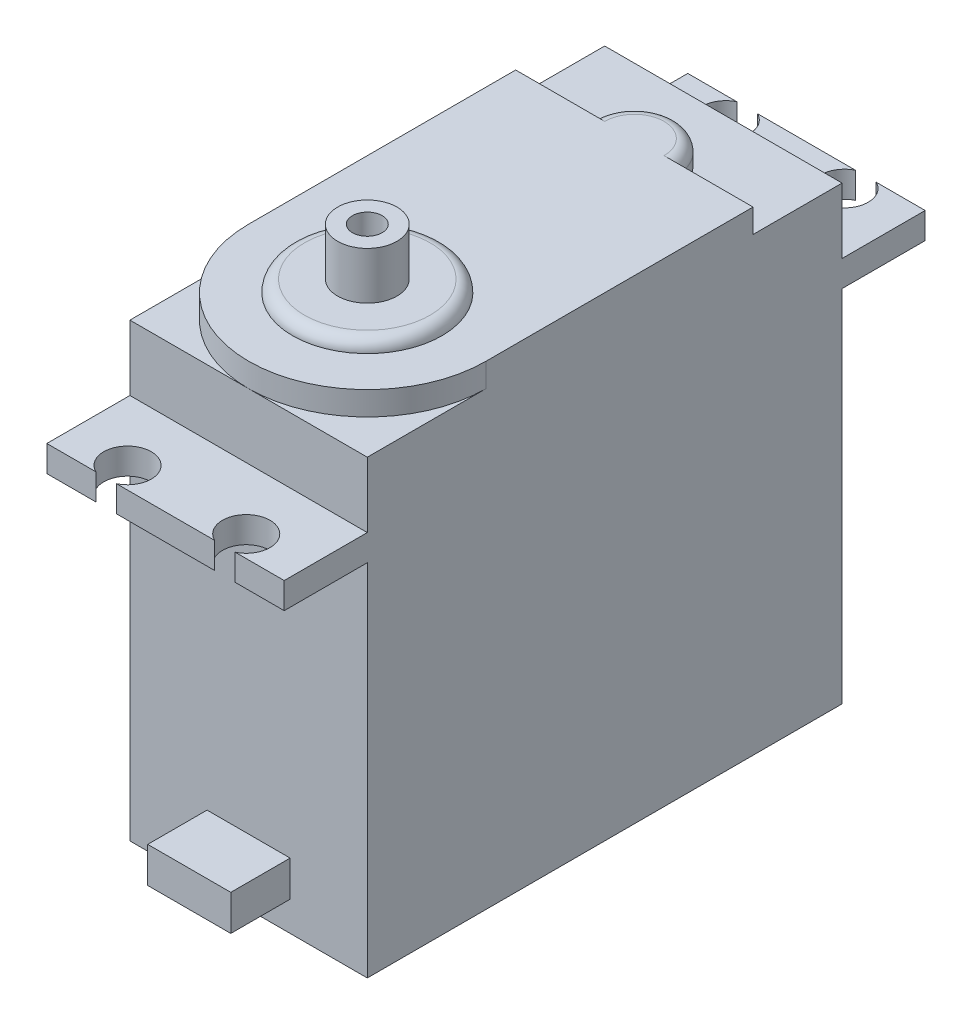
ISO-10303-21;
HEADER;
FILE_DESCRIPTION(('STEP AP214'),'2;1');
FILE_NAME('part.step','',(''),(''),'','','');
FILE_SCHEMA(('AUTOMOTIVE_DESIGN { 1 0 10303 214 1 1 1 1 }'));
ENDSEC;
DATA;
#1=APPLICATION_CONTEXT('core data for automotive mechanical design processes');
#2=APPLICATION_PROTOCOL_DEFINITION('international standard','automotive_design',2000,#1);
#3=PRODUCT_CONTEXT('',#1,'mechanical');
#4=PRODUCT('Part','Part','',(#3));
#5=PRODUCT_RELATED_PRODUCT_CATEGORY('part','',(#4));
#6=PRODUCT_DEFINITION_FORMATION('','',#4);
#7=PRODUCT_DEFINITION_CONTEXT('part definition',#1,'design');
#8=PRODUCT_DEFINITION('design','',#6,#7);
#9=PRODUCT_DEFINITION_SHAPE('','',#8);
#10=(LENGTH_UNIT() NAMED_UNIT(*) SI_UNIT(.MILLI.,.METRE.));
#11=(NAMED_UNIT(*) PLANE_ANGLE_UNIT() SI_UNIT($,.RADIAN.));
#12=(NAMED_UNIT(*) SI_UNIT($,.STERADIAN.) SOLID_ANGLE_UNIT());
#13=UNCERTAINTY_MEASURE_WITH_UNIT(LENGTH_MEASURE(1.E-05),#10,'distance_accuracy_value','');
#14=(GEOMETRIC_REPRESENTATION_CONTEXT(3) GLOBAL_UNCERTAINTY_ASSIGNED_CONTEXT((#13)) GLOBAL_UNIT_ASSIGNED_CONTEXT((#10,
#11,#12)) REPRESENTATION_CONTEXT('',''));
#15=CARTESIAN_POINT('',(0.,0.,0.));
#16=DIRECTION('',(0.,0.,1.));
#17=DIRECTION('',(1.,0.,0.));
#18=AXIS2_PLACEMENT_3D('',#15,#16,#17);
#19=CARTESIAN_POINT('',(0.,38.,0.));
#20=DIRECTION('',(0.,-1.,0.));
#21=DIRECTION('',(0.,0.,-1.));
#22=AXIS2_PLACEMENT_3D('',#19,#20,#21);
#23=PLANE('',#22);
#24=DIRECTION('',(-1.,0.,0.));
#25=VECTOR('',#24,1.);
#26=CARTESIAN_POINT('',(20.,38.,-32.5));
#27=LINE('',#26,#25);
#28=CARTESIAN_POINT('',(20.,38.,-32.5));
#29=VERTEX_POINT('',#28);
#30=CARTESIAN_POINT('',(13.5,38.,-32.5));
#31=VERTEX_POINT('',#30);
#32=EDGE_CURVE('E455',#29,#31,#27,.T.);
#33=ORIENTED_EDGE('',*,*,#32,.F.);
#34=DIRECTION('',(0.,0.,-1.));
#35=VECTOR('',#34,1.);
#36=CARTESIAN_POINT('',(20.,38.,0.));
#37=LINE('',#36,#35);
#38=CARTESIAN_POINT('',(20.,38.,-40.));
#39=VERTEX_POINT('',#38);
#40=EDGE_CURVE('E275',#29,#39,#37,.T.);
#41=ORIENTED_EDGE('',*,*,#40,.T.);
#42=DIRECTION('',(-1.,0.,0.));
#43=VECTOR('',#42,1.);
#44=CARTESIAN_POINT('',(0.,38.,-40.));
#45=LINE('',#44,#43);
#46=CARTESIAN_POINT('',(0.,38.,-40.));
#47=VERTEX_POINT('',#46);
#48=EDGE_CURVE('E404',#39,#47,#45,.T.);
#49=ORIENTED_EDGE('',*,*,#48,.T.);
#50=DIRECTION('',(0.,0.,1.));
#51=VECTOR('',#50,1.);
#52=CARTESIAN_POINT('',(0.,38.,0.));
#53=LINE('',#52,#51);
#54=CARTESIAN_POINT('',(0.,38.,-32.5));
#55=VERTEX_POINT('',#54);
#56=EDGE_CURVE('E395',#47,#55,#53,.T.);
#57=ORIENTED_EDGE('',*,*,#56,.T.);
#58=DIRECTION('',(-1.,0.,0.));
#59=VECTOR('',#58,1.);
#60=CARTESIAN_POINT('',(6.5,38.,-32.5));
#61=LINE('',#60,#59);
#62=CARTESIAN_POINT('',(6.5,38.,-32.5));
#63=VERTEX_POINT('',#62);
#64=EDGE_CURVE('E507',#63,#55,#61,.T.);
#65=ORIENTED_EDGE('',*,*,#64,.F.);
#66=CARTESIAN_POINT('',(10.,38.,-32.5));
#67=DIRECTION('',(0.,1.,0.));
#68=DIRECTION('',(0.,0.,1.));
#69=AXIS2_PLACEMENT_3D('',#66,#67,#68);
#70=CIRCLE('',#69,3.5);
#71=EDGE_CURVE('E531',#31,#63,#70,.T.);
#72=ORIENTED_EDGE('',*,*,#71,.F.);
#73=EDGE_LOOP('',(#33,#41,#49,#57,#65,#72));
#74=FACE_BOUND('',#73,.T.);
#75=ADVANCED_FACE('F45',(#74),#23,.F.);
#76=CARTESIAN_POINT('',(10.,38.,-10.));
#77=DIRECTION('',(0.,1.,0.));
#78=DIRECTION('',(0.,0.,1.));
#79=AXIS2_PLACEMENT_3D('',#76,#77,#78);
#80=CIRCLE('',#79,10.);
#81=CARTESIAN_POINT('',(0.,38.,-10.));
#82=VERTEX_POINT('',#81);
#83=CARTESIAN_POINT('',(10.,38.,0.));
#84=VERTEX_POINT('',#83);
#85=EDGE_CURVE('E269',#82,#84,#80,.T.);
#86=ORIENTED_EDGE('',*,*,#85,.F.);
#87=CARTESIAN_POINT('',(0.,38.,0.));
#88=VERTEX_POINT('',#87);
#89=EDGE_CURVE('E398',#82,#88,#53,.T.);
#90=ORIENTED_EDGE('',*,*,#89,.T.);
#91=DIRECTION('',(1.,0.,0.));
#92=VECTOR('',#91,1.);
#93=CARTESIAN_POINT('',(0.,38.,0.));
#94=LINE('',#93,#92);
#95=EDGE_CURVE('E399',#88,#84,#94,.T.);
#96=ORIENTED_EDGE('',*,*,#95,.T.);
#97=EDGE_LOOP('',(#86,#90,#96));
#98=FACE_BOUND('',#97,.T.);
#99=ADVANCED_FACE('F476',(#98),#23,.F.);
#100=CARTESIAN_POINT('',(0.,0.,-47.));
#101=DIRECTION('',(0.,0.,1.));
#102=DIRECTION('',(1.,0.,0.));
#103=AXIS2_PLACEMENT_3D('',#100,#101,#102);
#104=PLANE('',#103);
#105=DIRECTION('',(1.,0.,0.));
#106=VECTOR('',#105,1.);
#107=CARTESIAN_POINT('',(0.,30.3,-47.));
#108=LINE('',#107,#106);
#109=CARTESIAN_POINT('',(5.87177978870814,30.3,-47.));
#110=VERTEX_POINT('',#109);
#111=CARTESIAN_POINT('',(14.1282202112918,30.3,-47.));
#112=VERTEX_POINT('',#111);
#113=EDGE_CURVE('E330',#110,#112,#108,.T.);
#114=ORIENTED_EDGE('',*,*,#113,.F.);
#115=DIRECTION('',(0.,1.,0.));
#116=VECTOR('',#115,1.);
#117=CARTESIAN_POINT('',(5.87177978870814,25.5,-47.));
#118=LINE('',#117,#116);
#119=CARTESIAN_POINT('',(5.87177978870814,32.5,-47.));
#120=VERTEX_POINT('',#119);
#121=EDGE_CURVE('E303',#110,#120,#118,.T.);
#122=ORIENTED_EDGE('',*,*,#121,.T.);
#123=DIRECTION('',(-1.,0.,0.));
#124=VECTOR('',#123,1.);
#125=CARTESIAN_POINT('',(0.,32.5,-47.));
#126=LINE('',#125,#124);
#127=CARTESIAN_POINT('',(14.1282202112918,32.5,-47.));
#128=VERTEX_POINT('',#127);
#129=EDGE_CURVE('E338',#128,#120,#126,.T.);
#130=ORIENTED_EDGE('',*,*,#129,.F.);
#131=DIRECTION('',(0.,1.,0.));
#132=VECTOR('',#131,1.);
#133=CARTESIAN_POINT('',(14.1282202112918,25.5,-47.));
#134=LINE('',#133,#132);
#135=EDGE_CURVE('E292',#128,#112,#134,.F.);
#136=ORIENTED_EDGE('',*,*,#135,.T.);
#137=EDGE_LOOP('',(#114,#122,#130,#136));
#138=FACE_BOUND('',#137,.T.);
#139=ADVANCED_FACE('F483',(#138),#104,.F.);
#140=CARTESIAN_POINT('',(15.8717797887081,30.3,-47.));
#141=VERTEX_POINT('',#140);
#142=CARTESIAN_POINT('',(20.,30.3,-47.));
#143=VERTEX_POINT('',#142);
#144=EDGE_CURVE('E325',#141,#143,#108,.T.);
#145=ORIENTED_EDGE('',*,*,#144,.F.);
#146=DIRECTION('',(0.,1.,0.));
#147=VECTOR('',#146,1.);
#148=CARTESIAN_POINT('',(15.8717797887081,25.5,-47.));
#149=LINE('',#148,#147);
#150=CARTESIAN_POINT('',(15.8717797887081,32.5,-47.));
#151=VERTEX_POINT('',#150);
#152=EDGE_CURVE('E295',#141,#151,#149,.T.);
#153=ORIENTED_EDGE('',*,*,#152,.T.);
#154=CARTESIAN_POINT('',(20.,32.5,-47.));
#155=VERTEX_POINT('',#154);
#156=EDGE_CURVE('E334',#155,#151,#126,.T.);
#157=ORIENTED_EDGE('',*,*,#156,.F.);
#158=DIRECTION('',(0.,1.,0.));
#159=VECTOR('',#158,1.);
#160=CARTESIAN_POINT('',(20.,32.5,-47.));
#161=LINE('',#160,#159);
#162=EDGE_CURVE('E329',#143,#155,#161,.T.);
#163=ORIENTED_EDGE('',*,*,#162,.F.);
#164=EDGE_LOOP('',(#145,#153,#157,#163));
#165=FACE_BOUND('',#164,.T.);
#166=ADVANCED_FACE('F620',(#165),#104,.F.);
#167=CARTESIAN_POINT('',(0.,0.,7.));
#168=DIRECTION('',(0.,0.,1.));
#169=DIRECTION('',(1.,0.,0.));
#170=AXIS2_PLACEMENT_3D('',#167,#168,#169);
#171=PLANE('',#170);
#172=DIRECTION('',(0.,1.,0.));
#173=VECTOR('',#172,1.);
#174=CARTESIAN_POINT('',(15.8717797887082,25.5,7.));
#175=LINE('',#174,#173);
#176=CARTESIAN_POINT('',(15.8717797887082,30.3,7.));
#177=VERTEX_POINT('',#176);
#178=CARTESIAN_POINT('',(15.8717797887082,32.5,7.));
#179=VERTEX_POINT('',#178);
#180=EDGE_CURVE('E445',#177,#179,#175,.T.);
#181=ORIENTED_EDGE('',*,*,#180,.F.);
#182=DIRECTION('',(1.,0.,0.));
#183=VECTOR('',#182,1.);
#184=CARTESIAN_POINT('',(0.,30.3,7.));
#185=LINE('',#184,#183);
#186=CARTESIAN_POINT('',(20.,30.3,7.));
#187=VERTEX_POINT('',#186);
#188=EDGE_CURVE('E309',#177,#187,#185,.T.);
#189=ORIENTED_EDGE('',*,*,#188,.T.);
#190=DIRECTION('',(0.,1.,0.));
#191=VECTOR('',#190,1.);
#192=CARTESIAN_POINT('',(20.,32.5,7.));
#193=LINE('',#192,#191);
#194=CARTESIAN_POINT('',(20.,32.5,7.));
#195=VERTEX_POINT('',#194);
#196=EDGE_CURVE('E313',#187,#195,#193,.T.);
#197=ORIENTED_EDGE('',*,*,#196,.T.);
#198=DIRECTION('',(-1.,0.,0.));
#199=VECTOR('',#198,1.);
#200=CARTESIAN_POINT('',(0.,32.5,7.));
#201=LINE('',#200,#199);
#202=EDGE_CURVE('E318',#195,#179,#201,.T.);
#203=ORIENTED_EDGE('',*,*,#202,.T.);
#204=EDGE_LOOP('',(#181,#189,#197,#203));
#205=FACE_BOUND('',#204,.T.);
#206=ADVANCED_FACE('F613',(#205),#171,.T.);
#207=DIRECTION('',(0.,1.,0.));
#208=VECTOR('',#207,1.);
#209=CARTESIAN_POINT('',(14.1282202112919,25.5,7.));
#210=LINE('',#209,#208);
#211=CARTESIAN_POINT('',(14.1282202112919,32.5,7.));
#212=VERTEX_POINT('',#211);
#213=CARTESIAN_POINT('',(14.1282202112919,30.3,7.));
#214=VERTEX_POINT('',#213);
#215=EDGE_CURVE('E443',#212,#214,#210,.F.);
#216=ORIENTED_EDGE('',*,*,#215,.F.);
#217=CARTESIAN_POINT('',(5.87177978870814,32.5,7.));
#218=VERTEX_POINT('',#217);
#219=EDGE_CURVE('E322',#212,#218,#201,.T.);
#220=ORIENTED_EDGE('',*,*,#219,.T.);
#221=DIRECTION('',(0.,1.,0.));
#222=VECTOR('',#221,1.);
#223=CARTESIAN_POINT('',(5.87177978870814,25.5,7.));
#224=LINE('',#223,#222);
#225=CARTESIAN_POINT('',(5.87177978870814,30.3,7.));
#226=VERTEX_POINT('',#225);
#227=EDGE_CURVE('E441',#226,#218,#224,.T.);
#228=ORIENTED_EDGE('',*,*,#227,.F.);
#229=EDGE_CURVE('E314',#226,#214,#185,.T.);
#230=ORIENTED_EDGE('',*,*,#229,.T.);
#231=EDGE_LOOP('',(#216,#220,#228,#230));
#232=FACE_BOUND('',#231,.T.);
#233=ADVANCED_FACE('F609',(#232),#171,.T.);
#234=CARTESIAN_POINT('',(0.,38.,0.));
#235=DIRECTION('',(0.,0.,-1.));
#236=DIRECTION('',(-1.,0.,0.));
#237=AXIS2_PLACEMENT_3D('',#234,#235,#236);
#238=PLANE('',#237);
#239=DIRECTION('',(0.,-1.,0.));
#240=VECTOR('',#239,1.);
#241=CARTESIAN_POINT('',(0.,38.,0.));
#242=LINE('',#241,#240);
#243=CARTESIAN_POINT('',(0.,32.5,0.));
#244=VERTEX_POINT('',#243);
#245=EDGE_CURVE('E430',#88,#244,#242,.T.);
#246=ORIENTED_EDGE('',*,*,#245,.T.);
#247=DIRECTION('',(1.,0.,0.));
#248=VECTOR('',#247,1.);
#249=CARTESIAN_POINT('',(0.,32.5,0.));
#250=LINE('',#249,#248);
#251=CARTESIAN_POINT('',(20.,32.5,0.));
#252=VERTEX_POINT('',#251);
#253=EDGE_CURVE('E355',#244,#252,#250,.T.);
#254=ORIENTED_EDGE('',*,*,#253,.T.);
#255=DIRECTION('',(0.,-1.,0.));
#256=VECTOR('',#255,1.);
#257=CARTESIAN_POINT('',(20.,38.,0.));
#258=LINE('',#257,#256);
#259=CARTESIAN_POINT('',(20.,38.,0.));
#260=VERTEX_POINT('',#259);
#261=EDGE_CURVE('E426',#260,#252,#258,.T.);
#262=ORIENTED_EDGE('',*,*,#261,.F.);
#263=EDGE_CURVE('E397',#84,#260,#94,.T.);
#264=ORIENTED_EDGE('',*,*,#263,.F.);
#265=ORIENTED_EDGE('',*,*,#95,.F.);
#266=EDGE_LOOP('',(#246,#254,#262,#264,#265));
#267=FACE_BOUND('',#266,.T.);
#268=ADVANCED_FACE('F511',(#267),#238,.F.);
#269=CARTESIAN_POINT('',(0.,38.,-40.));
#270=DIRECTION('',(0.,0.,1.));
#271=DIRECTION('',(1.,0.,0.));
#272=AXIS2_PLACEMENT_3D('',#269,#270,#271);
#273=PLANE('',#272);
#274=DIRECTION('',(0.,-1.,0.));
#275=VECTOR('',#274,1.);
#276=CARTESIAN_POINT('',(20.,38.,-40.));
#277=LINE('',#276,#275);
#278=CARTESIAN_POINT('',(20.,32.5,-40.));
#279=VERTEX_POINT('',#278);
#280=EDGE_CURVE('E422',#39,#279,#277,.T.);
#281=ORIENTED_EDGE('',*,*,#280,.T.);
#282=DIRECTION('',(-1.,0.,0.));
#283=VECTOR('',#282,1.);
#284=CARTESIAN_POINT('',(0.,32.5,-40.));
#285=LINE('',#284,#283);
#286=CARTESIAN_POINT('',(0.,32.5,-40.));
#287=VERTEX_POINT('',#286);
#288=EDGE_CURVE('E436',#279,#287,#285,.T.);
#289=ORIENTED_EDGE('',*,*,#288,.T.);
#290=DIRECTION('',(0.,-1.,0.));
#291=VECTOR('',#290,1.);
#292=CARTESIAN_POINT('',(0.,38.,-40.));
#293=LINE('',#292,#291);
#294=EDGE_CURVE('E418',#47,#287,#293,.T.);
#295=ORIENTED_EDGE('',*,*,#294,.F.);
#296=ORIENTED_EDGE('',*,*,#48,.F.);
#297=EDGE_LOOP('',(#281,#289,#295,#296));
#298=FACE_BOUND('',#297,.T.);
#299=ADVANCED_FACE('F499',(#298),#273,.F.);
#300=CARTESIAN_POINT('',(20.,30.3,0.));
#301=VERTEX_POINT('',#300);
#302=CARTESIAN_POINT('',(20.,0.,0.));
#303=VERTEX_POINT('',#302);
#304=EDGE_CURVE('E425',#301,#303,#258,.T.);
#305=ORIENTED_EDGE('',*,*,#304,.F.);
#306=DIRECTION('',(-1.,0.,0.));
#307=VECTOR('',#306,1.);
#308=CARTESIAN_POINT('',(0.,30.3,0.));
#309=LINE('',#308,#307);
#310=CARTESIAN_POINT('',(0.,30.3,0.));
#311=VERTEX_POINT('',#310);
#312=EDGE_CURVE('E341',#301,#311,#309,.T.);
#313=ORIENTED_EDGE('',*,*,#312,.T.);
#314=CARTESIAN_POINT('',(0.,0.,0.));
#315=VERTEX_POINT('',#314);
#316=EDGE_CURVE('E429',#311,#315,#242,.T.);
#317=ORIENTED_EDGE('',*,*,#316,.T.);
#318=DIRECTION('',(1.,0.,0.));
#319=VECTOR('',#318,1.);
#320=CARTESIAN_POINT('',(0.,0.,0.));
#321=LINE('',#320,#319);
#322=EDGE_CURVE('E409',#315,#303,#321,.T.);
#323=ORIENTED_EDGE('',*,*,#322,.T.);
#324=EDGE_LOOP('',(#305,#313,#317,#323));
#325=FACE_BOUND('',#324,.T.);
#326=DIRECTION('',(0.,-1.,0.));
#327=VECTOR('',#326,1.);
#328=CARTESIAN_POINT('',(6.5,2.5,0.));
#329=LINE('',#328,#327);
#330=CARTESIAN_POINT('',(6.5,5.5,0.));
#331=VERTEX_POINT('',#330);
#332=CARTESIAN_POINT('',(6.5,2.5,0.));
#333=VERTEX_POINT('',#332);
#334=EDGE_CURVE('E361',#331,#333,#329,.T.);
#335=ORIENTED_EDGE('',*,*,#334,.F.);
#336=DIRECTION('',(-1.,0.,0.));
#337=VECTOR('',#336,1.);
#338=CARTESIAN_POINT('',(6.5,5.5,0.));
#339=LINE('',#338,#337);
#340=CARTESIAN_POINT('',(13.5,5.5,0.));
#341=VERTEX_POINT('',#340);
#342=EDGE_CURVE('E366',#341,#331,#339,.T.);
#343=ORIENTED_EDGE('',*,*,#342,.F.);
#344=DIRECTION('',(0.,1.,0.));
#345=VECTOR('',#344,1.);
#346=CARTESIAN_POINT('',(13.5,2.5,0.));
#347=LINE('',#346,#345);
#348=CARTESIAN_POINT('',(13.5,2.5,0.));
#349=VERTEX_POINT('',#348);
#350=EDGE_CURVE('E378',#349,#341,#347,.T.);
#351=ORIENTED_EDGE('',*,*,#350,.F.);
#352=DIRECTION('',(1.,0.,0.));
#353=VECTOR('',#352,1.);
#354=CARTESIAN_POINT('',(6.5,2.5,0.));
#355=LINE('',#354,#353);
#356=EDGE_CURVE('E375',#333,#349,#355,.T.);
#357=ORIENTED_EDGE('',*,*,#356,.F.);
#358=EDGE_LOOP('',(#335,#343,#351,#357));
#359=FACE_BOUND('',#358,.T.);
#360=ADVANCED_FACE('F590',(#325,#359),#238,.F.);
#361=CARTESIAN_POINT('',(0.,38.,0.));
#362=DIRECTION('',(1.,0.,0.));
#363=DIRECTION('',(0.,0.,-1.));
#364=AXIS2_PLACEMENT_3D('',#361,#362,#363);
#365=PLANE('',#364);
#366=ORIENTED_EDGE('',*,*,#316,.F.);
#367=DIRECTION('',(0.,0.,1.));
#368=VECTOR('',#367,1.);
#369=CARTESIAN_POINT('',(0.,30.3,-47.));
#370=LINE('',#369,#368);
#371=CARTESIAN_POINT('',(0.,30.3,7.));
#372=VERTEX_POINT('',#371);
#373=EDGE_CURVE('E337',#311,#372,#370,.T.);
#374=ORIENTED_EDGE('',*,*,#373,.T.);
#375=DIRECTION('',(0.,-1.,0.));
#376=VECTOR('',#375,1.);
#377=CARTESIAN_POINT('',(0.,32.5,7.));
#378=LINE('',#377,#376);
#379=CARTESIAN_POINT('',(0.,32.5,7.));
#380=VERTEX_POINT('',#379);
#381=EDGE_CURVE('E306',#380,#372,#378,.T.);
#382=ORIENTED_EDGE('',*,*,#381,.F.);
#383=DIRECTION('',(0.,0.,1.));
#384=VECTOR('',#383,1.);
#385=CARTESIAN_POINT('',(0.,32.5,-47.));
#386=LINE('',#385,#384);
#387=EDGE_CURVE('E342',#244,#380,#386,.T.);
#388=ORIENTED_EDGE('',*,*,#387,.F.);
#389=ORIENTED_EDGE('',*,*,#245,.F.);
#390=ORIENTED_EDGE('',*,*,#89,.F.);
#391=DIRECTION('',(0.,-1.,0.));
#392=VECTOR('',#391,1.);
#393=CARTESIAN_POINT('',(0.,40.,-10.));
#394=LINE('',#393,#392);
#395=CARTESIAN_POINT('',(0.,40.,-10.));
#396=VERTEX_POINT('',#395);
#397=EDGE_CURVE('E517',#396,#82,#394,.T.);
#398=ORIENTED_EDGE('',*,*,#397,.F.);
#399=DIRECTION('',(0.,0.,1.));
#400=VECTOR('',#399,1.);
#401=CARTESIAN_POINT('',(0.,40.,-32.5));
#402=LINE('',#401,#400);
#403=CARTESIAN_POINT('',(0.,40.,-32.5));
#404=VERTEX_POINT('',#403);
#405=EDGE_CURVE('E537',#404,#396,#402,.T.);
#406=ORIENTED_EDGE('',*,*,#405,.F.);
#407=DIRECTION('',(0.,-1.,0.));
#408=VECTOR('',#407,1.);
#409=CARTESIAN_POINT('',(0.,40.,-32.5));
#410=LINE('',#409,#408);
#411=EDGE_CURVE('E524',#404,#55,#410,.T.);
#412=ORIENTED_EDGE('',*,*,#411,.T.);
#413=ORIENTED_EDGE('',*,*,#56,.F.);
#414=ORIENTED_EDGE('',*,*,#294,.T.);
#415=CARTESIAN_POINT('',(0.,32.5,-47.));
#416=VERTEX_POINT('',#415);
#417=EDGE_CURVE('E339',#416,#287,#386,.T.);
#418=ORIENTED_EDGE('',*,*,#417,.F.);
#419=DIRECTION('',(0.,-1.,0.));
#420=VECTOR('',#419,1.);
#421=CARTESIAN_POINT('',(0.,32.5,-47.));
#422=LINE('',#421,#420);
#423=CARTESIAN_POINT('',(0.,30.3,-47.));
#424=VERTEX_POINT('',#423);
#425=EDGE_CURVE('E321',#416,#424,#422,.T.);
#426=ORIENTED_EDGE('',*,*,#425,.T.);
#427=CARTESIAN_POINT('',(0.,30.3,-40.));
#428=VERTEX_POINT('',#427);
#429=EDGE_CURVE('E350',#424,#428,#370,.T.);
#430=ORIENTED_EDGE('',*,*,#429,.T.);
#431=CARTESIAN_POINT('',(0.,0.,-40.));
#432=VERTEX_POINT('',#431);
#433=EDGE_CURVE('E406',#428,#432,#293,.T.);
#434=ORIENTED_EDGE('',*,*,#433,.T.);
#435=DIRECTION('',(0.,0.,1.));
#436=VECTOR('',#435,1.);
#437=CARTESIAN_POINT('',(0.,0.,0.));
#438=LINE('',#437,#436);
#439=EDGE_CURVE('E394',#432,#315,#438,.T.);
#440=ORIENTED_EDGE('',*,*,#439,.T.);
#441=EDGE_LOOP('',(#366,#374,#382,#388,#389,#390,#398,#406,#412,#413,#414,#418,#426,#430,#434,#440));
#442=FACE_BOUND('',#441,.T.);
#443=ADVANCED_FACE('F596',(#442),#365,.F.);
#444=CARTESIAN_POINT('',(20.,38.,0.));
#445=DIRECTION('',(-1.,0.,0.));
#446=DIRECTION('',(0.,0.,1.));
#447=AXIS2_PLACEMENT_3D('',#444,#445,#446);
#448=PLANE('',#447);
#449=CARTESIAN_POINT('',(20.,30.3,-40.));
#450=VERTEX_POINT('',#449);
#451=CARTESIAN_POINT('',(20.,0.,-40.));
#452=VERTEX_POINT('',#451);
#453=EDGE_CURVE('E421',#450,#452,#277,.T.);
#454=ORIENTED_EDGE('',*,*,#453,.F.);
#455=DIRECTION('',(0.,0.,1.));
#456=VECTOR('',#455,1.);
#457=CARTESIAN_POINT('',(20.,30.3,-47.));
#458=LINE('',#457,#456);
#459=EDGE_CURVE('E347',#143,#450,#458,.T.);
#460=ORIENTED_EDGE('',*,*,#459,.F.);
#461=ORIENTED_EDGE('',*,*,#162,.T.);
#462=DIRECTION('',(0.,0.,1.));
#463=VECTOR('',#462,1.);
#464=CARTESIAN_POINT('',(20.,32.5,-47.));
#465=LINE('',#464,#463);
#466=EDGE_CURVE('E343',#155,#279,#465,.T.);
#467=ORIENTED_EDGE('',*,*,#466,.T.);
#468=ORIENTED_EDGE('',*,*,#280,.F.);
#469=ORIENTED_EDGE('',*,*,#40,.F.);
#470=DIRECTION('',(0.,-1.,0.));
#471=VECTOR('',#470,1.);
#472=CARTESIAN_POINT('',(20.,40.,-32.5));
#473=LINE('',#472,#471);
#474=CARTESIAN_POINT('',(20.,40.,-32.5));
#475=VERTEX_POINT('',#474);
#476=EDGE_CURVE('E254',#475,#29,#473,.T.);
#477=ORIENTED_EDGE('',*,*,#476,.F.);
#478=DIRECTION('',(0.,0.,-1.));
#479=VECTOR('',#478,1.);
#480=CARTESIAN_POINT('',(20.,40.,-32.5));
#481=LINE('',#480,#479);
#482=CARTESIAN_POINT('',(20.,40.,-10.));
#483=VERTEX_POINT('',#482);
#484=EDGE_CURVE('E260',#483,#475,#481,.T.);
#485=ORIENTED_EDGE('',*,*,#484,.F.);
#486=DIRECTION('',(0.,-1.,0.));
#487=VECTOR('',#486,1.);
#488=CARTESIAN_POINT('',(20.,40.,-10.));
#489=LINE('',#488,#487);
#490=CARTESIAN_POINT('',(20.,38.,-10.));
#491=VERTEX_POINT('',#490);
#492=EDGE_CURVE('E521',#483,#491,#489,.T.);
#493=ORIENTED_EDGE('',*,*,#492,.T.);
#494=EDGE_CURVE('E402',#260,#491,#37,.T.);
#495=ORIENTED_EDGE('',*,*,#494,.F.);
#496=ORIENTED_EDGE('',*,*,#261,.T.);
#497=EDGE_CURVE('E346',#252,#195,#465,.T.);
#498=ORIENTED_EDGE('',*,*,#497,.T.);
#499=ORIENTED_EDGE('',*,*,#196,.F.);
#500=EDGE_CURVE('E349',#301,#187,#458,.T.);
#501=ORIENTED_EDGE('',*,*,#500,.F.);
#502=ORIENTED_EDGE('',*,*,#304,.T.);
#503=DIRECTION('',(0.,0.,-1.));
#504=VECTOR('',#503,1.);
#505=CARTESIAN_POINT('',(20.,0.,0.));
#506=LINE('',#505,#504);
#507=EDGE_CURVE('E412',#303,#452,#506,.T.);
#508=ORIENTED_EDGE('',*,*,#507,.T.);
#509=EDGE_LOOP('',(#454,#460,#461,#467,#468,#469,#477,#485,#493,#495,#496,#498,#499,#501,#502,#508));
#510=FACE_BOUND('',#509,.T.);
#511=ADVANCED_FACE('F273',(#510),#448,.F.);
#512=ORIENTED_EDGE('',*,*,#433,.F.);
#513=DIRECTION('',(1.,0.,0.));
#514=VECTOR('',#513,1.);
#515=CARTESIAN_POINT('',(0.,30.3,-40.));
#516=LINE('',#515,#514);
#517=EDGE_CURVE('E433',#428,#450,#516,.T.);
#518=ORIENTED_EDGE('',*,*,#517,.T.);
#519=ORIENTED_EDGE('',*,*,#453,.T.);
#520=DIRECTION('',(-1.,0.,0.));
#521=VECTOR('',#520,1.);
#522=CARTESIAN_POINT('',(0.,0.,-40.));
#523=LINE('',#522,#521);
#524=EDGE_CURVE('E415',#452,#432,#523,.T.);
#525=ORIENTED_EDGE('',*,*,#524,.T.);
#526=EDGE_LOOP('',(#512,#518,#519,#525));
#527=FACE_BOUND('',#526,.T.);
#528=ADVANCED_FACE('F489',(#527),#273,.F.);
#529=EDGE_CURVE('E501',#84,#491,#80,.T.);
#530=ORIENTED_EDGE('',*,*,#529,.F.);
#531=ORIENTED_EDGE('',*,*,#263,.T.);
#532=ORIENTED_EDGE('',*,*,#494,.T.);
#533=EDGE_LOOP('',(#530,#531,#532));
#534=FACE_BOUND('',#533,.T.);
#535=ADVANCED_FACE('F479',(#534),#23,.F.);
#536=CARTESIAN_POINT('',(0.,0.,0.));
#537=DIRECTION('',(0.,-1.,0.));
#538=DIRECTION('',(0.,0.,-1.));
#539=AXIS2_PLACEMENT_3D('',#536,#537,#538);
#540=PLANE('',#539);
#541=ORIENTED_EDGE('',*,*,#439,.F.);
#542=ORIENTED_EDGE('',*,*,#524,.F.);
#543=ORIENTED_EDGE('',*,*,#507,.F.);
#544=ORIENTED_EDGE('',*,*,#322,.F.);
#545=EDGE_LOOP('',(#541,#542,#543,#544));
#546=FACE_BOUND('',#545,.T.);
#547=ADVANCED_FACE('F488',(#546),#540,.T.);
#548=CARTESIAN_POINT('',(6.5,2.5,5.));
#549=DIRECTION('',(1.,0.,0.));
#550=DIRECTION('',(0.,0.,-1.));
#551=AXIS2_PLACEMENT_3D('',#548,#549,#550);
#552=PLANE('',#551);
#553=ORIENTED_EDGE('',*,*,#334,.T.);
#554=DIRECTION('',(0.,0.,-1.));
#555=VECTOR('',#554,1.);
#556=CARTESIAN_POINT('',(6.5,2.5,5.));
#557=LINE('',#556,#555);
#558=CARTESIAN_POINT('',(6.5,2.5,5.));
#559=VERTEX_POINT('',#558);
#560=EDGE_CURVE('E391',#559,#333,#557,.T.);
#561=ORIENTED_EDGE('',*,*,#560,.F.);
#562=DIRECTION('',(0.,-1.,0.));
#563=VECTOR('',#562,1.);
#564=CARTESIAN_POINT('',(6.5,2.5,5.));
#565=LINE('',#564,#563);
#566=CARTESIAN_POINT('',(6.5,5.5,5.));
#567=VERTEX_POINT('',#566);
#568=EDGE_CURVE('E362',#567,#559,#565,.T.);
#569=ORIENTED_EDGE('',*,*,#568,.F.);
#570=DIRECTION('',(0.,0.,-1.));
#571=VECTOR('',#570,1.);
#572=CARTESIAN_POINT('',(6.5,5.5,5.));
#573=LINE('',#572,#571);
#574=EDGE_CURVE('E372',#567,#331,#573,.T.);
#575=ORIENTED_EDGE('',*,*,#574,.T.);
#576=EDGE_LOOP('',(#553,#561,#569,#575));
#577=FACE_BOUND('',#576,.T.);
#578=ADVANCED_FACE('F495',(#577),#552,.F.);
#579=CARTESIAN_POINT('',(6.5,2.5,5.));
#580=DIRECTION('',(0.,1.,0.));
#581=DIRECTION('',(0.,0.,1.));
#582=AXIS2_PLACEMENT_3D('',#579,#580,#581);
#583=PLANE('',#582);
#584=ORIENTED_EDGE('',*,*,#356,.T.);
#585=DIRECTION('',(0.,0.,-1.));
#586=VECTOR('',#585,1.);
#587=CARTESIAN_POINT('',(13.5,2.5,5.));
#588=LINE('',#587,#586);
#589=CARTESIAN_POINT('',(13.5,2.5,5.));
#590=VERTEX_POINT('',#589);
#591=EDGE_CURVE('E388',#590,#349,#588,.T.);
#592=ORIENTED_EDGE('',*,*,#591,.F.);
#593=DIRECTION('',(1.,0.,0.));
#594=VECTOR('',#593,1.);
#595=CARTESIAN_POINT('',(6.5,2.5,5.));
#596=LINE('',#595,#594);
#597=EDGE_CURVE('E365',#559,#590,#596,.T.);
#598=ORIENTED_EDGE('',*,*,#597,.F.);
#599=ORIENTED_EDGE('',*,*,#560,.T.);
#600=EDGE_LOOP('',(#584,#592,#598,#599));
#601=FACE_BOUND('',#600,.T.);
#602=ADVANCED_FACE('F578',(#601),#583,.F.);
#603=CARTESIAN_POINT('',(13.5,2.5,5.));
#604=DIRECTION('',(-1.,0.,0.));
#605=DIRECTION('',(0.,0.,1.));
#606=AXIS2_PLACEMENT_3D('',#603,#604,#605);
#607=PLANE('',#606);
#608=ORIENTED_EDGE('',*,*,#350,.T.);
#609=DIRECTION('',(0.,0.,-1.));
#610=VECTOR('',#609,1.);
#611=CARTESIAN_POINT('',(13.5,5.5,5.));
#612=LINE('',#611,#610);
#613=CARTESIAN_POINT('',(13.5,5.5,5.));
#614=VERTEX_POINT('',#613);
#615=EDGE_CURVE('E385',#614,#341,#612,.T.);
#616=ORIENTED_EDGE('',*,*,#615,.F.);
#617=DIRECTION('',(0.,1.,0.));
#618=VECTOR('',#617,1.);
#619=CARTESIAN_POINT('',(13.5,2.5,5.));
#620=LINE('',#619,#618);
#621=EDGE_CURVE('E368',#590,#614,#620,.T.);
#622=ORIENTED_EDGE('',*,*,#621,.F.);
#623=ORIENTED_EDGE('',*,*,#591,.T.);
#624=EDGE_LOOP('',(#608,#616,#622,#623));
#625=FACE_BOUND('',#624,.T.);
#626=ADVANCED_FACE('F574',(#625),#607,.F.);
#627=CARTESIAN_POINT('',(6.5,5.5,5.));
#628=DIRECTION('',(0.,-1.,0.));
#629=DIRECTION('',(0.,0.,-1.));
#630=AXIS2_PLACEMENT_3D('',#627,#628,#629);
#631=PLANE('',#630);
#632=ORIENTED_EDGE('',*,*,#342,.T.);
#633=ORIENTED_EDGE('',*,*,#574,.F.);
#634=DIRECTION('',(-1.,0.,0.));
#635=VECTOR('',#634,1.);
#636=CARTESIAN_POINT('',(6.5,5.5,5.));
#637=LINE('',#636,#635);
#638=EDGE_CURVE('E370',#614,#567,#637,.T.);
#639=ORIENTED_EDGE('',*,*,#638,.F.);
#640=ORIENTED_EDGE('',*,*,#615,.T.);
#641=EDGE_LOOP('',(#632,#633,#639,#640));
#642=FACE_BOUND('',#641,.T.);
#643=ADVANCED_FACE('F570',(#642),#631,.F.);
#644=CARTESIAN_POINT('',(0.,0.,5.));
#645=DIRECTION('',(0.,0.,-1.));
#646=DIRECTION('',(-1.,0.,0.));
#647=AXIS2_PLACEMENT_3D('',#644,#645,#646);
#648=PLANE('',#647);
#649=ORIENTED_EDGE('',*,*,#568,.T.);
#650=ORIENTED_EDGE('',*,*,#597,.T.);
#651=ORIENTED_EDGE('',*,*,#621,.T.);
#652=ORIENTED_EDGE('',*,*,#638,.T.);
#653=EDGE_LOOP('',(#649,#650,#651,#652));
#654=FACE_BOUND('',#653,.T.);
#655=ADVANCED_FACE('F566',(#654),#648,.F.);
#656=CARTESIAN_POINT('',(4.12822021129186,32.5,-47.));
#657=VERTEX_POINT('',#656);
#658=EDGE_CURVE('E333',#657,#416,#126,.T.);
#659=ORIENTED_EDGE('',*,*,#658,.F.);
#660=DIRECTION('',(0.,1.,0.));
#661=VECTOR('',#660,1.);
#662=CARTESIAN_POINT('',(4.12822021129186,25.5,-47.));
#663=LINE('',#662,#661);
#664=CARTESIAN_POINT('',(4.12822021129186,30.3,-47.));
#665=VERTEX_POINT('',#664);
#666=EDGE_CURVE('E300',#657,#665,#663,.F.);
#667=ORIENTED_EDGE('',*,*,#666,.T.);
#668=EDGE_CURVE('E326',#424,#665,#108,.T.);
#669=ORIENTED_EDGE('',*,*,#668,.F.);
#670=ORIENTED_EDGE('',*,*,#425,.F.);
#671=EDGE_LOOP('',(#659,#667,#669,#670));
#672=FACE_BOUND('',#671,.T.);
#673=ADVANCED_FACE('F569',(#672),#104,.F.);
#674=CARTESIAN_POINT('',(0.,30.3,-47.));
#675=DIRECTION('',(0.,-1.,0.));
#676=DIRECTION('',(0.,0.,-1.));
#677=AXIS2_PLACEMENT_3D('',#674,#675,#676);
#678=PLANE('',#677);
#679=CARTESIAN_POINT('',(5.,30.3,-45.2));
#680=DIRECTION('',(0.,-1.,0.));
#681=DIRECTION('',(0.,0.,-1.));
#682=AXIS2_PLACEMENT_3D('',#679,#680,#681);
#683=CIRCLE('',#682,2.00000000000001);
#684=EDGE_CURVE('E298',#110,#665,#683,.T.);
#685=ORIENTED_EDGE('',*,*,#684,.F.);
#686=ORIENTED_EDGE('',*,*,#113,.T.);
#687=CARTESIAN_POINT('',(15.,30.3,-45.2));
#688=DIRECTION('',(0.,-1.,0.));
#689=DIRECTION('',(0.,0.,-1.));
#690=AXIS2_PLACEMENT_3D('',#687,#688,#689);
#691=CIRCLE('',#690,2.00000000000001);
#692=EDGE_CURVE('E290',#141,#112,#691,.T.);
#693=ORIENTED_EDGE('',*,*,#692,.F.);
#694=ORIENTED_EDGE('',*,*,#144,.T.);
#695=ORIENTED_EDGE('',*,*,#459,.T.);
#696=ORIENTED_EDGE('',*,*,#517,.F.);
#697=ORIENTED_EDGE('',*,*,#429,.F.);
#698=ORIENTED_EDGE('',*,*,#668,.T.);
#699=EDGE_LOOP('',(#685,#686,#693,#694,#695,#696,#697,#698));
#700=FACE_BOUND('',#699,.T.);
#701=ADVANCED_FACE('F638',(#700),#678,.T.);
#702=CARTESIAN_POINT('',(0.,32.5,-47.));
#703=DIRECTION('',(0.,1.,0.));
#704=DIRECTION('',(0.,0.,1.));
#705=AXIS2_PLACEMENT_3D('',#702,#703,#704);
#706=PLANE('',#705);
#707=CARTESIAN_POINT('',(5.,32.5,-45.2));
#708=DIRECTION('',(0.,1.,0.));
#709=DIRECTION('',(0.,0.,1.));
#710=AXIS2_PLACEMENT_3D('',#707,#708,#709);
#711=CIRCLE('',#710,2.00000000000001);
#712=EDGE_CURVE('E449',#657,#120,#711,.T.);
#713=ORIENTED_EDGE('',*,*,#712,.F.);
#714=ORIENTED_EDGE('',*,*,#658,.T.);
#715=ORIENTED_EDGE('',*,*,#417,.T.);
#716=ORIENTED_EDGE('',*,*,#288,.F.);
#717=ORIENTED_EDGE('',*,*,#466,.F.);
#718=ORIENTED_EDGE('',*,*,#156,.T.);
#719=CARTESIAN_POINT('',(15.,32.5,-45.2));
#720=DIRECTION('',(0.,1.,0.));
#721=DIRECTION('',(0.,0.,1.));
#722=AXIS2_PLACEMENT_3D('',#719,#720,#721);
#723=CIRCLE('',#722,2.00000000000001);
#724=EDGE_CURVE('E447',#128,#151,#723,.T.);
#725=ORIENTED_EDGE('',*,*,#724,.F.);
#726=ORIENTED_EDGE('',*,*,#129,.T.);
#727=EDGE_LOOP('',(#713,#714,#715,#716,#717,#718,#725,#726));
#728=FACE_BOUND('',#727,.T.);
#729=ADVANCED_FACE('F792',(#728),#706,.T.);
#730=CARTESIAN_POINT('',(15.,32.5,5.2));
#731=DIRECTION('',(0.,1.,0.));
#732=DIRECTION('',(0.,0.,1.));
#733=AXIS2_PLACEMENT_3D('',#730,#731,#732);
#734=CIRCLE('',#733,2.00000000000001);
#735=EDGE_CURVE('E279',#179,#212,#734,.T.);
#736=ORIENTED_EDGE('',*,*,#735,.F.);
#737=ORIENTED_EDGE('',*,*,#202,.F.);
#738=ORIENTED_EDGE('',*,*,#497,.F.);
#739=ORIENTED_EDGE('',*,*,#253,.F.);
#740=ORIENTED_EDGE('',*,*,#387,.T.);
#741=CARTESIAN_POINT('',(4.12822021129186,32.5,7.));
#742=VERTEX_POINT('',#741);
#743=EDGE_CURVE('E317',#742,#380,#201,.T.);
#744=ORIENTED_EDGE('',*,*,#743,.F.);
#745=CARTESIAN_POINT('',(5.,32.5,5.2));
#746=DIRECTION('',(0.,1.,0.));
#747=DIRECTION('',(0.,0.,1.));
#748=AXIS2_PLACEMENT_3D('',#745,#746,#747);
#749=CIRCLE('',#748,2.);
#750=EDGE_CURVE('E276',#218,#742,#749,.T.);
#751=ORIENTED_EDGE('',*,*,#750,.F.);
#752=ORIENTED_EDGE('',*,*,#219,.F.);
#753=EDGE_LOOP('',(#736,#737,#738,#739,#740,#744,#751,#752));
#754=FACE_BOUND('',#753,.T.);
#755=ADVANCED_FACE('F636',(#754),#706,.T.);
#756=CARTESIAN_POINT('',(15.,30.3,5.2));
#757=DIRECTION('',(0.,-1.,0.));
#758=DIRECTION('',(0.,0.,-1.));
#759=AXIS2_PLACEMENT_3D('',#756,#757,#758);
#760=CIRCLE('',#759,2.00000000000001);
#761=EDGE_CURVE('E288',#214,#177,#760,.T.);
#762=ORIENTED_EDGE('',*,*,#761,.F.);
#763=ORIENTED_EDGE('',*,*,#229,.F.);
#764=CARTESIAN_POINT('',(5.,30.3,5.2));
#765=DIRECTION('',(0.,-1.,0.));
#766=DIRECTION('',(0.,0.,-1.));
#767=AXIS2_PLACEMENT_3D('',#764,#765,#766);
#768=CIRCLE('',#767,2.);
#769=CARTESIAN_POINT('',(4.12822021129186,30.3,7.));
#770=VERTEX_POINT('',#769);
#771=EDGE_CURVE('E286',#770,#226,#768,.T.);
#772=ORIENTED_EDGE('',*,*,#771,.F.);
#773=EDGE_CURVE('E310',#372,#770,#185,.T.);
#774=ORIENTED_EDGE('',*,*,#773,.F.);
#775=ORIENTED_EDGE('',*,*,#373,.F.);
#776=ORIENTED_EDGE('',*,*,#312,.F.);
#777=ORIENTED_EDGE('',*,*,#500,.T.);
#778=ORIENTED_EDGE('',*,*,#188,.F.);
#779=EDGE_LOOP('',(#762,#763,#772,#774,#775,#776,#777,#778));
#780=FACE_BOUND('',#779,.T.);
#781=ADVANCED_FACE('F627',(#780),#678,.T.);
#782=DIRECTION('',(0.,1.,0.));
#783=VECTOR('',#782,1.);
#784=CARTESIAN_POINT('',(4.12822021129186,25.5,7.));
#785=LINE('',#784,#783);
#786=EDGE_CURVE('E439',#742,#770,#785,.F.);
#787=ORIENTED_EDGE('',*,*,#786,.F.);
#788=ORIENTED_EDGE('',*,*,#743,.T.);
#789=ORIENTED_EDGE('',*,*,#381,.T.);
#790=ORIENTED_EDGE('',*,*,#773,.T.);
#791=EDGE_LOOP('',(#787,#788,#789,#790));
#792=FACE_BOUND('',#791,.T.);
#793=ADVANCED_FACE('F616',(#792),#171,.T.);
#794=CARTESIAN_POINT('',(5.,25.5,5.2));
#795=DIRECTION('',(0.,1.,0.));
#796=DIRECTION('',(0.,0.,1.));
#797=AXIS2_PLACEMENT_3D('',#794,#795,#796);
#798=CYLINDRICAL_SURFACE('',#797,2.);
#799=ORIENTED_EDGE('',*,*,#227,.T.);
#800=ORIENTED_EDGE('',*,*,#750,.T.);
#801=ORIENTED_EDGE('',*,*,#786,.T.);
#802=ORIENTED_EDGE('',*,*,#771,.T.);
#803=EDGE_LOOP('',(#799,#800,#801,#802));
#804=FACE_BOUND('',#803,.T.);
#805=ADVANCED_FACE('F626',(#804),#798,.F.);
#806=CARTESIAN_POINT('',(15.,25.5,5.2));
#807=DIRECTION('',(0.,1.,0.));
#808=DIRECTION('',(0.,0.,1.));
#809=AXIS2_PLACEMENT_3D('',#806,#807,#808);
#810=CYLINDRICAL_SURFACE('',#809,2.00000000000001);
#811=ORIENTED_EDGE('',*,*,#180,.T.);
#812=ORIENTED_EDGE('',*,*,#735,.T.);
#813=ORIENTED_EDGE('',*,*,#215,.T.);
#814=ORIENTED_EDGE('',*,*,#761,.T.);
#815=EDGE_LOOP('',(#811,#812,#813,#814));
#816=FACE_BOUND('',#815,.T.);
#817=ADVANCED_FACE('F633',(#816),#810,.F.);
#818=CARTESIAN_POINT('',(15.,25.5,-45.2));
#819=DIRECTION('',(0.,1.,0.));
#820=DIRECTION('',(0.,0.,1.));
#821=AXIS2_PLACEMENT_3D('',#818,#819,#820);
#822=CYLINDRICAL_SURFACE('',#821,2.00000000000001);
#823=ORIENTED_EDGE('',*,*,#692,.T.);
#824=ORIENTED_EDGE('',*,*,#135,.F.);
#825=ORIENTED_EDGE('',*,*,#724,.T.);
#826=ORIENTED_EDGE('',*,*,#152,.F.);
#827=EDGE_LOOP('',(#823,#824,#825,#826));
#828=FACE_BOUND('',#827,.T.);
#829=ADVANCED_FACE('F664',(#828),#822,.F.);
#830=CARTESIAN_POINT('',(5.,25.5,-45.2));
#831=DIRECTION('',(0.,1.,0.));
#832=DIRECTION('',(0.,0.,1.));
#833=AXIS2_PLACEMENT_3D('',#830,#831,#832);
#834=CYLINDRICAL_SURFACE('',#833,2.00000000000001);
#835=ORIENTED_EDGE('',*,*,#684,.T.);
#836=ORIENTED_EDGE('',*,*,#666,.F.);
#837=ORIENTED_EDGE('',*,*,#712,.T.);
#838=ORIENTED_EDGE('',*,*,#121,.F.);
#839=EDGE_LOOP('',(#835,#836,#837,#838));
#840=FACE_BOUND('',#839,.T.);
#841=ADVANCED_FACE('F669',(#840),#834,.F.);
#842=CARTESIAN_POINT('',(20.,40.,-32.5));
#843=DIRECTION('',(0.,0.,1.));
#844=DIRECTION('',(1.,0.,0.));
#845=AXIS2_PLACEMENT_3D('',#842,#843,#844);
#846=PLANE('',#845);
#847=ORIENTED_EDGE('',*,*,#32,.T.);
#848=DIRECTION('',(0.,-1.,0.));
#849=VECTOR('',#848,1.);
#850=CARTESIAN_POINT('',(13.5,40.,-32.5));
#851=LINE('',#850,#849);
#852=CARTESIAN_POINT('',(13.5,39.,-32.5));
#853=VERTEX_POINT('',#852);
#854=EDGE_CURVE('E277',#853,#31,#851,.T.);
#855=ORIENTED_EDGE('',*,*,#854,.F.);
#856=CARTESIAN_POINT('',(12.5,39.,-32.5));
#857=DIRECTION('',(0.,0.,1.));
#858=DIRECTION('',(1.,0.,0.));
#859=AXIS2_PLACEMENT_3D('',#856,#857,#858);
#860=CIRCLE('',#859,1.);
#861=CARTESIAN_POINT('',(12.5,40.,-32.5));
#862=VERTEX_POINT('',#861);
#863=EDGE_CURVE('E11',#853,#862,#860,.T.);
#864=ORIENTED_EDGE('',*,*,#863,.T.);
#865=DIRECTION('',(-1.,0.,0.));
#866=VECTOR('',#865,1.);
#867=CARTESIAN_POINT('',(20.,40.,-32.5));
#868=LINE('',#867,#866);
#869=EDGE_CURVE('E249',#475,#862,#868,.T.);
#870=ORIENTED_EDGE('',*,*,#869,.F.);
#871=ORIENTED_EDGE('',*,*,#476,.T.);
#872=EDGE_LOOP('',(#847,#855,#864,#870,#871));
#873=FACE_BOUND('',#872,.T.);
#874=ADVANCED_FACE('F252',(#873),#846,.F.);
#875=CARTESIAN_POINT('',(10.,40.,-32.5));
#876=DIRECTION('',(0.,-1.,0.));
#877=DIRECTION('',(0.,0.,-1.));
#878=AXIS2_PLACEMENT_3D('',#875,#876,#877);
#879=CYLINDRICAL_SURFACE('',#878,3.5);
#880=DIRECTION('',(0.,-1.,0.));
#881=VECTOR('',#880,1.);
#882=CARTESIAN_POINT('',(6.5,40.,-32.5));
#883=LINE('',#882,#881);
#884=CARTESIAN_POINT('',(6.5,39.,-32.5));
#885=VERTEX_POINT('',#884);
#886=EDGE_CURVE('E281',#885,#63,#883,.T.);
#887=ORIENTED_EDGE('',*,*,#886,.F.);
#888=CARTESIAN_POINT('',(10.,39.,-32.5));
#889=DIRECTION('',(0.,1.,0.));
#890=DIRECTION('',(0.,0.,1.));
#891=AXIS2_PLACEMENT_3D('',#888,#889,#890);
#892=CIRCLE('',#891,3.5);
#893=EDGE_CURVE('E60',#885,#853,#892,.F.);
#894=ORIENTED_EDGE('',*,*,#893,.T.);
#895=ORIENTED_EDGE('',*,*,#854,.T.);
#896=ORIENTED_EDGE('',*,*,#71,.T.);
#897=EDGE_LOOP('',(#887,#894,#895,#896));
#898=FACE_BOUND('',#897,.T.);
#899=ADVANCED_FACE('F533',(#898),#879,.T.);
#900=CARTESIAN_POINT('',(6.5,40.,-32.5));
#901=DIRECTION('',(0.,0.,1.));
#902=DIRECTION('',(1.,0.,0.));
#903=AXIS2_PLACEMENT_3D('',#900,#901,#902);
#904=PLANE('',#903);
#905=ORIENTED_EDGE('',*,*,#64,.T.);
#906=ORIENTED_EDGE('',*,*,#411,.F.);
#907=DIRECTION('',(-1.,0.,0.));
#908=VECTOR('',#907,1.);
#909=CARTESIAN_POINT('',(6.5,40.,-32.5));
#910=LINE('',#909,#908);
#911=CARTESIAN_POINT('',(7.5,40.,-32.5));
#912=VERTEX_POINT('',#911);
#913=EDGE_CURVE('E259',#912,#404,#910,.T.);
#914=ORIENTED_EDGE('',*,*,#913,.F.);
#915=CARTESIAN_POINT('',(7.5,39.,-32.5));
#916=DIRECTION('',(0.,0.,1.));
#917=DIRECTION('',(1.,0.,0.));
#918=AXIS2_PLACEMENT_3D('',#915,#916,#917);
#919=CIRCLE('',#918,1.);
#920=EDGE_CURVE('E53',#912,#885,#919,.T.);
#921=ORIENTED_EDGE('',*,*,#920,.T.);
#922=ORIENTED_EDGE('',*,*,#886,.T.);
#923=EDGE_LOOP('',(#905,#906,#914,#921,#922));
#924=FACE_BOUND('',#923,.T.);
#925=ADVANCED_FACE('F528',(#924),#904,.F.);
#926=CARTESIAN_POINT('',(10.,40.,-10.));
#927=DIRECTION('',(0.,-1.,0.));
#928=DIRECTION('',(0.,0.,-1.));
#929=AXIS2_PLACEMENT_3D('',#926,#927,#928);
#930=CYLINDRICAL_SURFACE('',#929,10.);
#931=ORIENTED_EDGE('',*,*,#85,.T.);
#932=ORIENTED_EDGE('',*,*,#529,.T.);
#933=ORIENTED_EDGE('',*,*,#492,.F.);
#934=CARTESIAN_POINT('',(10.,40.,-10.));
#935=DIRECTION('',(0.,1.,0.));
#936=DIRECTION('',(0.,0.,1.));
#937=AXIS2_PLACEMENT_3D('',#934,#935,#936);
#938=CIRCLE('',#937,10.);
#939=EDGE_CURVE('E265',#396,#483,#938,.T.);
#940=ORIENTED_EDGE('',*,*,#939,.F.);
#941=ORIENTED_EDGE('',*,*,#397,.T.);
#942=EDGE_LOOP('',(#931,#932,#933,#940,#941));
#943=FACE_BOUND('',#942,.T.);
#944=ADVANCED_FACE('F515',(#943),#930,.T.);
#945=CARTESIAN_POINT('',(10.,40.,-10.));
#946=DIRECTION('',(0.,1.,0.));
#947=DIRECTION('',(0.,0.,1.));
#948=AXIS2_PLACEMENT_3D('',#945,#946,#947);
#949=PLANE('',#948);
#950=CARTESIAN_POINT('',(10.,40.,-10.));
#951=DIRECTION('',(0.,1.,0.));
#952=DIRECTION('',(0.,0.,1.));
#953=AXIS2_PLACEMENT_3D('',#950,#951,#952);
#954=CIRCLE('',#953,6.28945461064793);
#955=CARTESIAN_POINT('',(10.,40.,-3.71054538935207));
#956=VERTEX_POINT('',#955);
#957=EDGE_CURVE('E456',#956,#956,#954,.T.);
#958=ORIENTED_EDGE('',*,*,#957,.F.);
#959=EDGE_LOOP('',(#958));
#960=FACE_BOUND('',#959,.T.);
#961=CARTESIAN_POINT('',(10.,40.,-32.5));
#962=DIRECTION('',(0.,1.,0.));
#963=DIRECTION('',(0.,0.,1.));
#964=AXIS2_PLACEMENT_3D('',#961,#962,#963);
#965=CIRCLE('',#964,2.5);
#966=EDGE_CURVE('E459',#862,#912,#965,.T.);
#967=ORIENTED_EDGE('',*,*,#966,.T.);
#968=ORIENTED_EDGE('',*,*,#913,.T.);
#969=ORIENTED_EDGE('',*,*,#405,.T.);
#970=ORIENTED_EDGE('',*,*,#939,.T.);
#971=ORIENTED_EDGE('',*,*,#484,.T.);
#972=ORIENTED_EDGE('',*,*,#869,.T.);
#973=EDGE_LOOP('',(#967,#968,#969,#970,#971,#972));
#974=FACE_BOUND('',#973,.T.);
#975=ADVANCED_FACE('F263',(#960,#974),#949,.T.);
#976=CARTESIAN_POINT('',(10.,41.,-10.));
#977=DIRECTION('',(0.,1.,0.));
#978=DIRECTION('',(0.,0.,1.));
#979=AXIS2_PLACEMENT_3D('',#976,#977,#978);
#980=PLANE('',#979);
#981=CARTESIAN_POINT('',(10.,41.,-10.));
#982=DIRECTION('',(0.,1.,0.));
#983=DIRECTION('',(0.,0.,1.));
#984=AXIS2_PLACEMENT_3D('',#981,#982,#983);
#985=CIRCLE('',#984,5.28945461064793);
#986=CARTESIAN_POINT('',(10.,41.,-4.71054538935207));
#987=VERTEX_POINT('',#986);
#988=EDGE_CURVE('E451',#987,#987,#985,.T.);
#989=ORIENTED_EDGE('',*,*,#988,.T.);
#990=EDGE_LOOP('',(#989));
#991=FACE_BOUND('',#990,.T.);
#992=CARTESIAN_POINT('',(10.,41.,-10.));
#993=DIRECTION('',(0.,1.,0.));
#994=DIRECTION('',(0.,0.,1.));
#995=AXIS2_PLACEMENT_3D('',#992,#993,#994);
#996=CIRCLE('',#995,2.5);
#997=CARTESIAN_POINT('',(10.,41.,-12.5));
#998=VERTEX_POINT('',#997);
#999=EDGE_CURVE('E452',#998,#998,#996,.T.);
#1000=ORIENTED_EDGE('',*,*,#999,.F.);
#1001=EDGE_LOOP('',(#1000));
#1002=FACE_BOUND('',#1001,.T.);
#1003=ADVANCED_FACE('F555',(#991,#1002),#980,.T.);
#1004=CARTESIAN_POINT('',(10.,45.,-10.));
#1005=DIRECTION('',(0.,1.,0.));
#1006=DIRECTION('',(0.,0.,1.));
#1007=AXIS2_PLACEMENT_3D('',#1004,#1005,#1006);
#1008=PLANE('',#1007);
#1009=CARTESIAN_POINT('',(10.,45.,-10.));
#1010=DIRECTION('',(0.,1.,0.));
#1011=DIRECTION('',(0.,0.,1.));
#1012=AXIS2_PLACEMENT_3D('',#1009,#1010,#1011);
#1013=CIRCLE('',#1012,1.25);
#1014=CARTESIAN_POINT('',(10.,45.,-8.75));
#1015=VERTEX_POINT('',#1014);
#1016=EDGE_CURVE('E543',#1015,#1015,#1013,.T.);
#1017=ORIENTED_EDGE('',*,*,#1016,.F.);
#1018=EDGE_LOOP('',(#1017));
#1019=FACE_BOUND('',#1018,.T.);
#1020=CARTESIAN_POINT('',(10.,45.,-10.));
#1021=DIRECTION('',(0.,1.,0.));
#1022=DIRECTION('',(0.,0.,1.));
#1023=AXIS2_PLACEMENT_3D('',#1020,#1021,#1022);
#1024=CIRCLE('',#1023,2.5);
#1025=CARTESIAN_POINT('',(10.,45.,-12.5));
#1026=VERTEX_POINT('',#1025);
#1027=EDGE_CURVE('E358',#1026,#1026,#1024,.T.);
#1028=ORIENTED_EDGE('',*,*,#1027,.T.);
#1029=EDGE_LOOP('',(#1028));
#1030=FACE_BOUND('',#1029,.T.);
#1031=ADVANCED_FACE('F552',(#1019,#1030),#1008,.T.);
#1032=CARTESIAN_POINT('',(10.,45.,-10.));
#1033=DIRECTION('',(0.,-1.,0.));
#1034=DIRECTION('',(0.,0.,-1.));
#1035=AXIS2_PLACEMENT_3D('',#1032,#1033,#1034);
#1036=CYLINDRICAL_SURFACE('',#1035,2.5);
#1037=CARTESIAN_POINT('',(10.,41.,-12.5));
#1038=CARTESIAN_POINT('',(10.,41.0416666666667,-12.5));
#1039=CARTESIAN_POINT('',(10.,41.0833333333333,-12.5));
#1040=CARTESIAN_POINT('',(10.,41.1666666666667,-12.5));
#1041=CARTESIAN_POINT('',(10.,41.2083333333333,-12.5));
#1042=CARTESIAN_POINT('',(10.,41.2916666666667,-12.5));
#1043=CARTESIAN_POINT('',(10.,41.3333333333333,-12.5));
#1044=CARTESIAN_POINT('',(10.,41.4166666666667,-12.5));
#1045=CARTESIAN_POINT('',(10.,41.4583333333333,-12.5));
#1046=CARTESIAN_POINT('',(10.,41.5416666666667,-12.5));
#1047=CARTESIAN_POINT('',(10.,41.5833333333333,-12.5));
#1048=CARTESIAN_POINT('',(10.,41.6666666666667,-12.5));
#1049=CARTESIAN_POINT('',(10.,41.7083333333333,-12.5));
#1050=CARTESIAN_POINT('',(10.,41.7916666666667,-12.5));
#1051=CARTESIAN_POINT('',(10.,41.8333333333333,-12.5));
#1052=CARTESIAN_POINT('',(10.,41.9166666666667,-12.5));
#1053=CARTESIAN_POINT('',(10.,41.9583333333333,-12.5));
#1054=CARTESIAN_POINT('',(10.,42.0416666666667,-12.5));
#1055=CARTESIAN_POINT('',(10.,42.0833333333333,-12.5));
#1056=CARTESIAN_POINT('',(10.,42.1666666666667,-12.5));
#1057=CARTESIAN_POINT('',(10.,42.2083333333333,-12.5));
#1058=CARTESIAN_POINT('',(10.,42.2916666666667,-12.5));
#1059=CARTESIAN_POINT('',(10.,42.3333333333333,-12.5));
#1060=CARTESIAN_POINT('',(10.,42.4166666666667,-12.5));
#1061=CARTESIAN_POINT('',(10.,42.4583333333333,-12.5));
#1062=CARTESIAN_POINT('',(10.,42.5416666666667,-12.5));
#1063=CARTESIAN_POINT('',(10.,42.5833333333333,-12.5));
#1064=CARTESIAN_POINT('',(10.,42.6666666666667,-12.5));
#1065=CARTESIAN_POINT('',(10.,42.7083333333333,-12.5));
#1066=CARTESIAN_POINT('',(10.,42.7916666666667,-12.5));
#1067=CARTESIAN_POINT('',(10.,42.8333333333333,-12.5));
#1068=CARTESIAN_POINT('',(10.,42.9166666666667,-12.5));
#1069=CARTESIAN_POINT('',(10.,42.9583333333333,-12.5));
#1070=CARTESIAN_POINT('',(10.,43.0416666666667,-12.5));
#1071=CARTESIAN_POINT('',(10.,43.0833333333333,-12.5));
#1072=CARTESIAN_POINT('',(10.,43.1666666666667,-12.5));
#1073=CARTESIAN_POINT('',(10.,43.2083333333333,-12.5));
#1074=CARTESIAN_POINT('',(10.,43.2916666666667,-12.5));
#1075=CARTESIAN_POINT('',(10.,43.3333333333333,-12.5));
#1076=CARTESIAN_POINT('',(10.,43.4166666666667,-12.5));
#1077=CARTESIAN_POINT('',(10.,43.4583333333333,-12.5));
#1078=CARTESIAN_POINT('',(10.,43.5416666666667,-12.5));
#1079=CARTESIAN_POINT('',(10.,43.5833333333333,-12.5));
#1080=CARTESIAN_POINT('',(10.,43.6666666666667,-12.5));
#1081=CARTESIAN_POINT('',(10.,43.7083333333333,-12.5));
#1082=CARTESIAN_POINT('',(10.,43.7916666666667,-12.5));
#1083=CARTESIAN_POINT('',(10.,43.8333333333333,-12.5));
#1084=CARTESIAN_POINT('',(10.,43.9166666666667,-12.5));
#1085=CARTESIAN_POINT('',(10.,43.9583333333333,-12.5));
#1086=CARTESIAN_POINT('',(10.,44.0416666666667,-12.5));
#1087=CARTESIAN_POINT('',(10.,44.0833333333333,-12.5));
#1088=CARTESIAN_POINT('',(10.,44.1666666666667,-12.5));
#1089=CARTESIAN_POINT('',(10.,44.2083333333333,-12.5));
#1090=CARTESIAN_POINT('',(10.,44.2916666666667,-12.5));
#1091=CARTESIAN_POINT('',(10.,44.3333333333333,-12.5));
#1092=CARTESIAN_POINT('',(10.,44.4166666666667,-12.5));
#1093=CARTESIAN_POINT('',(10.,44.4583333333333,-12.5));
#1094=CARTESIAN_POINT('',(10.,44.5416666666667,-12.5));
#1095=CARTESIAN_POINT('',(10.,44.5833333333333,-12.5));
#1096=CARTESIAN_POINT('',(10.,44.6666666666667,-12.5));
#1097=CARTESIAN_POINT('',(10.,44.7083333333333,-12.5));
#1098=CARTESIAN_POINT('',(10.,44.7916666666667,-12.5));
#1099=CARTESIAN_POINT('',(10.,44.8333333333333,-12.5));
#1100=CARTESIAN_POINT('',(10.,44.9166666666667,-12.5));
#1101=CARTESIAN_POINT('',(10.,44.9583333333333,-12.5));
#1102=CARTESIAN_POINT('',(10.,45.,-12.5));
#1103=B_SPLINE_CURVE_WITH_KNOTS('',3,(#1037,#1038,#1039,#1040,#1041,#1042,#1043,#1044,#1045,
#1046,#1047,#1048,#1049,#1050,#1051,#1052,#1053,#1054,#1055,#1056,#1057,#1058,#1059,#1060,#1061,
#1062,#1063,#1064,#1065,#1066,#1067,#1068,#1069,#1070,#1071,#1072,#1073,#1074,#1075,#1076,#1077,
#1078,#1079,#1080,#1081,#1082,#1083,#1084,#1085,#1086,#1087,#1088,#1089,#1090,#1091,#1092,#1093,
#1094,#1095,#1096,#1097,#1098,#1099,#1100,#1101,#1102),.UNSPECIFIED.,.F.,.F.,(4,2,2,2,2,2,2,2,2,
2,2,2,2,2,2,2,2,2,2,2,2,2,2,2,2,2,2,2,2,2,2,2,4),(0.,0.125,0.249999999999993,0.374999999999993,
0.499999999999994,0.624999999999994,0.749999999999994,0.874999999999994,0.999999999999994,
1.12499999999999,1.24999999999999,1.37499999999999,1.49999999999999,1.62499999999999,
1.74999999999999,1.87499999999999,1.99999999999999,2.125,2.25,2.375,2.5,2.625,2.75,2.875,3.,
3.125,3.25,3.375,3.5,3.625,3.75,3.875,4.),.UNSPECIFIED.);
#1104=EDGE_CURVE('BSEAM473',#998,#1026,#1103,.T.);
#1105=ORIENTED_EDGE('',*,*,#999,.T.);
#1106=ORIENTED_EDGE('',*,*,#1027,.F.);
#1107=ORIENTED_EDGE('',*,*,#1104,.T.);
#1108=ORIENTED_EDGE('',*,*,#1104,.F.);
#1109=EDGE_LOOP('',(#1105,#1107,#1106,#1108));
#1110=FACE_BOUND('',#1109,.T.);
#1111=ADVANCED_FACE('F473',(#1110),#1036,.T.);
#1112=CARTESIAN_POINT('',(10.,40.,-10.));
#1113=DIRECTION('',(0.,1.,0.));
#1114=DIRECTION('',(0.,0.,1.));
#1115=AXIS2_PLACEMENT_3D('',#1112,#1113,#1114);
#1116=TOROIDAL_SURFACE('',#1115,5.28945461064793,1.);
#1117=ORIENTED_EDGE('',*,*,#957,.T.);
#1118=EDGE_LOOP('',(#1117));
#1119=FACE_BOUND('',#1118,.T.);
#1120=ORIENTED_EDGE('',*,*,#988,.F.);
#1121=EDGE_LOOP('',(#1120));
#1122=FACE_BOUND('',#1121,.T.);
#1123=ADVANCED_FACE('F465',(#1119,#1122),#1116,.T.);
#1124=CARTESIAN_POINT('',(10.,39.,-32.5));
#1125=DIRECTION('',(0.,1.,0.));
#1126=DIRECTION('',(0.,0.,1.));
#1127=AXIS2_PLACEMENT_3D('',#1124,#1125,#1126);
#1128=TOROIDAL_SURFACE('',#1127,2.5,1.);
#1129=ORIENTED_EDGE('',*,*,#863,.F.);
#1130=ORIENTED_EDGE('',*,*,#893,.F.);
#1131=ORIENTED_EDGE('',*,*,#920,.F.);
#1132=ORIENTED_EDGE('',*,*,#966,.F.);
#1133=EDGE_LOOP('',(#1129,#1130,#1131,#1132));
#1134=FACE_BOUND('',#1133,.T.);
#1135=ADVANCED_FACE('F47',(#1134),#1128,.T.);
#1136=CARTESIAN_POINT('',(10.,40.,-10.));
#1137=DIRECTION('',(0.,1.,0.));
#1138=DIRECTION('',(0.,0.,1.));
#1139=AXIS2_PLACEMENT_3D('',#1136,#1137,#1138);
#1140=CYLINDRICAL_SURFACE('',#1139,1.25);
#1141=CARTESIAN_POINT('',(10.,40.,-10.));
#1142=DIRECTION('',(0.,1.,0.));
#1143=DIRECTION('',(0.,0.,1.));
#1144=AXIS2_PLACEMENT_3D('',#1141,#1142,#1143);
#1145=CIRCLE('',#1144,1.25);
#1146=CARTESIAN_POINT('',(10.,40.,-8.75));
#1147=VERTEX_POINT('',#1146);
#1148=EDGE_CURVE('E542',#1147,#1147,#1145,.T.);
#1149=ORIENTED_EDGE('',*,*,#1148,.F.);
#1150=EDGE_LOOP('',(#1149));
#1151=FACE_BOUND('',#1150,.T.);
#1152=ORIENTED_EDGE('',*,*,#1016,.T.);
#1153=EDGE_LOOP('',(#1152));
#1154=FACE_BOUND('',#1153,.T.);
#1155=ADVANCED_FACE('F464',(#1151,#1154),#1140,.F.);
#1156=CARTESIAN_POINT('',(10.,40.,-10.));
#1157=DIRECTION('',(0.,1.,0.));
#1158=DIRECTION('',(0.,0.,1.));
#1159=AXIS2_PLACEMENT_3D('',#1156,#1157,#1158);
#1160=PLANE('',#1159);
#1161=ORIENTED_EDGE('',*,*,#1148,.T.);
#1162=EDGE_LOOP('',(#1161));
#1163=FACE_BOUND('',#1162,.T.);
#1164=ADVANCED_FACE('F470',(#1163),#1160,.T.);
#1165=CLOSED_SHELL('',(#75,#99,#139,#166,#206,#233,#268,#299,#360,#443,#511,#528,#535,#547,#578,
#602,#626,#643,#655,#673,#701,#729,#755,#781,#793,#805,#817,#829,#841,#874,#899,#925,#944,#975,
#1003,#1031,#1111,#1123,#1135,#1155,#1164));
#1166=MANIFOLD_SOLID_BREP('B2',#1165);
#1167=ADVANCED_BREP_SHAPE_REPRESENTATION('',(#18,#1166),#14);
#1168=SHAPE_DEFINITION_REPRESENTATION(#9,#1167);
ENDSEC;
END-ISO-10303-21;
